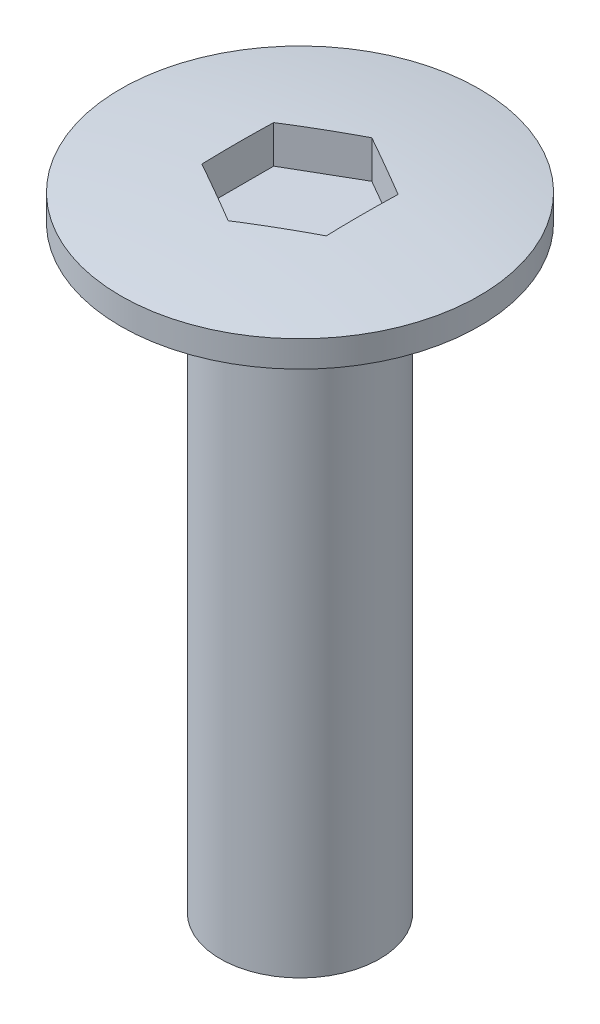
ISO-10303-21;
HEADER;
FILE_DESCRIPTION(('STEP AP214'),'2;1');
FILE_NAME('part.step','',(''),(''),'','','');
FILE_SCHEMA(('AUTOMOTIVE_DESIGN { 1 0 10303 214 1 1 1 1 }'));
ENDSEC;
DATA;
#1=APPLICATION_CONTEXT('core data for automotive mechanical design processes');
#2=APPLICATION_PROTOCOL_DEFINITION('international standard','automotive_design',2000,#1);
#3=PRODUCT_CONTEXT('',#1,'mechanical');
#4=PRODUCT('Part','Part','',(#3));
#5=PRODUCT_RELATED_PRODUCT_CATEGORY('part','',(#4));
#6=PRODUCT_DEFINITION_FORMATION('','',#4);
#7=PRODUCT_DEFINITION_CONTEXT('part definition',#1,'design');
#8=PRODUCT_DEFINITION('design','',#6,#7);
#9=PRODUCT_DEFINITION_SHAPE('','',#8);
#10=(LENGTH_UNIT() NAMED_UNIT(*) SI_UNIT(.MILLI.,.METRE.));
#11=(NAMED_UNIT(*) PLANE_ANGLE_UNIT() SI_UNIT($,.RADIAN.));
#12=(NAMED_UNIT(*) SI_UNIT($,.STERADIAN.) SOLID_ANGLE_UNIT());
#13=UNCERTAINTY_MEASURE_WITH_UNIT(LENGTH_MEASURE(1.E-05),#10,'distance_accuracy_value','');
#14=(GEOMETRIC_REPRESENTATION_CONTEXT(3) GLOBAL_UNCERTAINTY_ASSIGNED_CONTEXT((#13)) GLOBAL_UNIT_ASSIGNED_CONTEXT((#10,
#11,#12)) REPRESENTATION_CONTEXT('',''));
#15=CARTESIAN_POINT('',(0.,0.,0.));
#16=DIRECTION('',(0.,0.,1.));
#17=DIRECTION('',(1.,0.,0.));
#18=AXIS2_PLACEMENT_3D('',#15,#16,#17);
#19=CARTESIAN_POINT('',(0.,1.,0.));
#20=DIRECTION('',(0.,-1.,0.));
#21=DIRECTION('',(0.,0.,-1.));
#22=AXIS2_PLACEMENT_3D('',#19,#20,#21);
#23=CYLINDRICAL_SURFACE('',#22,4.5);
#24=CARTESIAN_POINT('',(0.,0.,0.));
#25=DIRECTION('',(0.,1.,0.));
#26=DIRECTION('',(0.,0.,1.));
#27=AXIS2_PLACEMENT_3D('',#24,#25,#26);
#28=CIRCLE('',#27,4.5);
#29=CARTESIAN_POINT('',(0.,0.,4.5));
#30=VERTEX_POINT('',#29);
#31=EDGE_CURVE('E127',#30,#30,#28,.T.);
#32=ORIENTED_EDGE('',*,*,#31,.T.);
#33=EDGE_LOOP('',(#32));
#34=FACE_BOUND('',#33,.T.);
#35=CARTESIAN_POINT('',(0.,0.66057989992778,0.));
#36=DIRECTION('',(0.,-1.,0.));
#37=DIRECTION('',(0.,0.,-1.));
#38=AXIS2_PLACEMENT_3D('',#35,#36,#37);
#39=CIRCLE('',#38,4.5);
#40=CARTESIAN_POINT('',(0.,0.66057989992778,-4.5));
#41=VERTEX_POINT('',#40);
#42=EDGE_CURVE('E116',#41,#41,#39,.F.);
#43=ORIENTED_EDGE('',*,*,#42,.F.);
#44=EDGE_LOOP('',(#43));
#45=FACE_BOUND('',#44,.T.);
#46=ADVANCED_FACE('F35',(#34,#45),#23,.T.);
#47=CARTESIAN_POINT('',(0.,0.,0.));
#48=DIRECTION('',(0.,1.,0.));
#49=DIRECTION('',(0.,0.,1.));
#50=AXIS2_PLACEMENT_3D('',#47,#48,#49);
#51=PLANE('',#50);
#52=CARTESIAN_POINT('',(0.,0.,0.));
#53=DIRECTION('',(0.,-1.,0.));
#54=DIRECTION('',(0.,0.,-1.));
#55=AXIS2_PLACEMENT_3D('',#52,#53,#54);
#56=CIRCLE('',#55,2.);
#57=CARTESIAN_POINT('',(0.,0.,-2.));
#58=VERTEX_POINT('',#57);
#59=EDGE_CURVE('E128',#58,#58,#56,.T.);
#60=ORIENTED_EDGE('',*,*,#59,.F.);
#61=EDGE_LOOP('',(#60));
#62=FACE_BOUND('',#61,.T.);
#63=ORIENTED_EDGE('',*,*,#31,.F.);
#64=EDGE_LOOP('',(#63));
#65=FACE_BOUND('',#64,.T.);
#66=ADVANCED_FACE('F169',(#62,#65),#51,.F.);
#67=CARTESIAN_POINT('',(0.,-15.,0.));
#68=DIRECTION('',(0.,1.,0.));
#69=DIRECTION('',(0.,0.,1.));
#70=AXIS2_PLACEMENT_3D('',#67,#68,#69);
#71=CYLINDRICAL_SURFACE('',#70,2.);
#72=CARTESIAN_POINT('',(0.,-15.,0.));
#73=DIRECTION('',(0.,-1.,0.));
#74=DIRECTION('',(0.,0.,-1.));
#75=AXIS2_PLACEMENT_3D('',#72,#73,#74);
#76=CIRCLE('',#75,2.);
#77=CARTESIAN_POINT('',(0.,-15.,-2.));
#78=VERTEX_POINT('',#77);
#79=EDGE_CURVE('E124',#78,#78,#76,.T.);
#80=ORIENTED_EDGE('',*,*,#79,.F.);
#81=EDGE_LOOP('',(#80));
#82=FACE_BOUND('',#81,.T.);
#83=ORIENTED_EDGE('',*,*,#59,.T.);
#84=EDGE_LOOP('',(#83));
#85=FACE_BOUND('',#84,.T.);
#86=ADVANCED_FACE('F174',(#82,#85),#71,.T.);
#87=CARTESIAN_POINT('',(0.,-15.,0.));
#88=DIRECTION('',(0.,-1.,0.));
#89=DIRECTION('',(0.,0.,-1.));
#90=AXIS2_PLACEMENT_3D('',#87,#88,#89);
#91=PLANE('',#90);
#92=ORIENTED_EDGE('',*,*,#79,.T.);
#93=EDGE_LOOP('',(#92));
#94=FACE_BOUND('',#93,.T.);
#95=ADVANCED_FACE('F180',(#94),#91,.T.);
#96=CARTESIAN_POINT('',(0.,-29.,0.));
#97=DIRECTION('',(0.,-1.,0.));
#98=DIRECTION('',(1.,0.,0.));
#99=AXIS2_PLACEMENT_3D('',#96,#97,#98);
#100=SPHERICAL_SURFACE('',#99,30.);
#101=CARTESIAN_POINT('',(-0.780455035167538,-29.,-1.35178777393315));
#102=DIRECTION('',(-0.499999999999995,0.,-0.866025403784441));
#103=DIRECTION('',(-0.866025403784442,0.,0.499999999999995));
#104=AXIS2_PLACEMENT_3D('',#101,#102,#103);
#105=CIRCLE('',#104,29.9593651426783);
#106=CARTESIAN_POINT('',(0.,0.945807937056932,-1.80238369857752));
#107=VERTEX_POINT('',#106);
#108=CARTESIAN_POINT('',(-1.56091007033508,0.945807937056932,-0.901191849288778));
#109=VERTEX_POINT('',#108);
#110=EDGE_CURVE('E11',#107,#109,#105,.F.);
#111=ORIENTED_EDGE('',*,*,#110,.F.);
#112=CARTESIAN_POINT('',(0.780455035167544,-29.,-1.35178777393314));
#113=DIRECTION('',(0.500000000000001,0.,-0.866025403784438));
#114=DIRECTION('',(-0.866025403784438,0.,-0.500000000000001));
#115=AXIS2_PLACEMENT_3D('',#112,#113,#114);
#116=CIRCLE('',#115,29.9593651426783);
#117=CARTESIAN_POINT('',(1.56091007033509,0.945807937056932,-0.901191849288756));
#118=VERTEX_POINT('',#117);
#119=EDGE_CURVE('E88',#118,#107,#116,.F.);
#120=ORIENTED_EDGE('',*,*,#119,.F.);
#121=CARTESIAN_POINT('',(1.56091007033509,-29.,0.));
#122=DIRECTION('',(1.,0.,0.));
#123=DIRECTION('',(0.,0.,-1.));
#124=AXIS2_PLACEMENT_3D('',#121,#122,#123);
#125=CIRCLE('',#124,29.9593651426783);
#126=CARTESIAN_POINT('',(1.56091007033508,0.945807937056932,0.901191849288767));
#127=VERTEX_POINT('',#126);
#128=EDGE_CURVE('E136',#127,#118,#125,.F.);
#129=ORIENTED_EDGE('',*,*,#128,.F.);
#130=CARTESIAN_POINT('',(0.780455035167535,-29.,1.35178777393314));
#131=DIRECTION('',(0.499999999999995,0.,0.866025403784442));
#132=DIRECTION('',(0.866025403784442,0.,-0.499999999999995));
#133=AXIS2_PLACEMENT_3D('',#130,#131,#132);
#134=CIRCLE('',#133,29.9593651426783);
#135=CARTESIAN_POINT('',(0.,0.945807937056932,1.80238369857752));
#136=VERTEX_POINT('',#135);
#137=EDGE_CURVE('E138',#136,#127,#134,.F.);
#138=ORIENTED_EDGE('',*,*,#137,.F.);
#139=CARTESIAN_POINT('',(-0.780455035167554,-29.,1.35178777393313));
#140=DIRECTION('',(-0.500000000000007,0.,0.866025403784435));
#141=DIRECTION('',(0.866025403784434,0.,0.500000000000007));
#142=AXIS2_PLACEMENT_3D('',#139,#140,#141);
#143=CIRCLE('',#142,29.9593651426783);
#144=CARTESIAN_POINT('',(-1.5609100703351,0.945807937056932,0.901191849288745));
#145=VERTEX_POINT('',#144);
#146=EDGE_CURVE('E140',#145,#136,#143,.F.);
#147=ORIENTED_EDGE('',*,*,#146,.F.);
#148=CARTESIAN_POINT('',(-1.56091007033509,-29.,0.));
#149=DIRECTION('',(-1.,0.,0.));
#150=DIRECTION('',(0.,0.,1.));
#151=AXIS2_PLACEMENT_3D('',#148,#149,#150);
#152=CIRCLE('',#151,29.9593651426783);
#153=EDGE_CURVE('E42',#109,#145,#152,.F.);
#154=ORIENTED_EDGE('',*,*,#153,.F.);
#155=EDGE_LOOP('',(#111,#120,#129,#138,#147,#154));
#156=FACE_BOUND('',#155,.T.);
#157=ORIENTED_EDGE('',*,*,#42,.T.);
#158=EDGE_LOOP('',(#157));
#159=FACE_BOUND('',#158,.T.);
#160=ADVANCED_FACE('F152',(#156,#159),#100,.T.);
#161=CARTESIAN_POINT('',(-1.56091007033508,1.,-0.901191849288778));
#162=DIRECTION('',(-0.499999999999995,0.,-0.866025403784441));
#163=DIRECTION('',(-0.866025403784442,0.,0.499999999999995));
#164=AXIS2_PLACEMENT_3D('',#161,#162,#163);
#165=PLANE('',#164);
#166=ORIENTED_EDGE('',*,*,#110,.T.);
#167=DIRECTION('',(0.,-1.,0.));
#168=VECTOR('',#167,1.);
#169=CARTESIAN_POINT('',(-1.56091007033508,1.,-0.901191849288778));
#170=LINE('',#169,#168);
#171=CARTESIAN_POINT('',(-1.56091007033508,0.,-0.901191849288778));
#172=VERTEX_POINT('',#171);
#173=EDGE_CURVE('E104',#109,#172,#170,.T.);
#174=ORIENTED_EDGE('',*,*,#173,.T.);
#175=DIRECTION('',(0.866025403784441,0.,-0.499999999999995));
#176=VECTOR('',#175,1.);
#177=CARTESIAN_POINT('',(-1.56091007033508,0.,-0.901191849288778));
#178=LINE('',#177,#176);
#179=CARTESIAN_POINT('',(0.,0.,-1.80238369857752));
#180=VERTEX_POINT('',#179);
#181=EDGE_CURVE('E97',#172,#180,#178,.T.);
#182=ORIENTED_EDGE('',*,*,#181,.T.);
#183=DIRECTION('',(0.,-1.,0.));
#184=VECTOR('',#183,1.);
#185=CARTESIAN_POINT('',(0.,1.,-1.80238369857752));
#186=LINE('',#185,#184);
#187=EDGE_CURVE('E83',#107,#180,#186,.T.);
#188=ORIENTED_EDGE('',*,*,#187,.F.);
#189=EDGE_LOOP('',(#166,#174,#182,#188));
#190=FACE_BOUND('',#189,.T.);
#191=ADVANCED_FACE('F103',(#190),#165,.F.);
#192=CARTESIAN_POINT('',(-1.56091007033509,1.,0.901191849288745));
#193=DIRECTION('',(-1.,0.,0.));
#194=DIRECTION('',(0.,0.,1.));
#195=AXIS2_PLACEMENT_3D('',#192,#193,#194);
#196=PLANE('',#195);
#197=ORIENTED_EDGE('',*,*,#153,.T.);
#198=DIRECTION('',(0.,-1.,0.));
#199=VECTOR('',#198,1.);
#200=CARTESIAN_POINT('',(-1.56091007033509,1.,0.901191849288745));
#201=LINE('',#200,#199);
#202=CARTESIAN_POINT('',(-1.56091007033509,0.,0.901191849288745));
#203=VERTEX_POINT('',#202);
#204=EDGE_CURVE('E117',#145,#203,#201,.T.);
#205=ORIENTED_EDGE('',*,*,#204,.T.);
#206=DIRECTION('',(0.,0.,-1.));
#207=VECTOR('',#206,1.);
#208=CARTESIAN_POINT('',(-1.56091007033509,0.,0.901191849288745));
#209=LINE('',#208,#207);
#210=EDGE_CURVE('E90',#203,#172,#209,.T.);
#211=ORIENTED_EDGE('',*,*,#210,.T.);
#212=ORIENTED_EDGE('',*,*,#173,.F.);
#213=EDGE_LOOP('',(#197,#205,#211,#212));
#214=FACE_BOUND('',#213,.T.);
#215=ADVANCED_FACE('F144',(#214),#196,.F.);
#216=CARTESIAN_POINT('',(0.,1.,1.80238369857752));
#217=DIRECTION('',(-0.500000000000007,0.,0.866025403784435));
#218=DIRECTION('',(0.866025403784434,0.,0.500000000000007));
#219=AXIS2_PLACEMENT_3D('',#216,#217,#218);
#220=PLANE('',#219);
#221=ORIENTED_EDGE('',*,*,#146,.T.);
#222=DIRECTION('',(0.,-1.,0.));
#223=VECTOR('',#222,1.);
#224=CARTESIAN_POINT('',(0.,1.,1.80238369857752));
#225=LINE('',#224,#223);
#226=CARTESIAN_POINT('',(0.,0.,1.80238369857752));
#227=VERTEX_POINT('',#226);
#228=EDGE_CURVE('E119',#136,#227,#225,.T.);
#229=ORIENTED_EDGE('',*,*,#228,.T.);
#230=DIRECTION('',(-0.866025403784435,0.,-0.500000000000007));
#231=VECTOR('',#230,1.);
#232=CARTESIAN_POINT('',(0.,0.,1.80238369857752));
#233=LINE('',#232,#231);
#234=EDGE_CURVE('E111',#227,#203,#233,.T.);
#235=ORIENTED_EDGE('',*,*,#234,.T.);
#236=ORIENTED_EDGE('',*,*,#204,.F.);
#237=EDGE_LOOP('',(#221,#229,#235,#236));
#238=FACE_BOUND('',#237,.T.);
#239=ADVANCED_FACE('F148',(#238),#220,.F.);
#240=CARTESIAN_POINT('',(1.56091007033508,1.,0.901191849288767));
#241=DIRECTION('',(0.499999999999995,0.,0.866025403784442));
#242=DIRECTION('',(0.866025403784442,0.,-0.499999999999995));
#243=AXIS2_PLACEMENT_3D('',#240,#241,#242);
#244=PLANE('',#243);
#245=ORIENTED_EDGE('',*,*,#137,.T.);
#246=DIRECTION('',(0.,-1.,0.));
#247=VECTOR('',#246,1.);
#248=CARTESIAN_POINT('',(1.56091007033508,1.,0.901191849288767));
#249=LINE('',#248,#247);
#250=CARTESIAN_POINT('',(1.56091007033508,0.,0.901191849288767));
#251=VERTEX_POINT('',#250);
#252=EDGE_CURVE('E121',#127,#251,#249,.T.);
#253=ORIENTED_EDGE('',*,*,#252,.T.);
#254=DIRECTION('',(-0.866025403784442,0.,0.499999999999995));
#255=VECTOR('',#254,1.);
#256=CARTESIAN_POINT('',(1.56091007033508,0.,0.901191849288767));
#257=LINE('',#256,#255);
#258=EDGE_CURVE('E108',#251,#227,#257,.T.);
#259=ORIENTED_EDGE('',*,*,#258,.T.);
#260=ORIENTED_EDGE('',*,*,#228,.F.);
#261=EDGE_LOOP('',(#245,#253,#259,#260));
#262=FACE_BOUND('',#261,.T.);
#263=ADVANCED_FACE('F157',(#262),#244,.F.);
#264=CARTESIAN_POINT('',(1.56091007033509,1.,-0.901191849288756));
#265=DIRECTION('',(1.,0.,0.));
#266=DIRECTION('',(0.,0.,-1.));
#267=AXIS2_PLACEMENT_3D('',#264,#265,#266);
#268=PLANE('',#267);
#269=ORIENTED_EDGE('',*,*,#128,.T.);
#270=DIRECTION('',(0.,-1.,0.));
#271=VECTOR('',#270,1.);
#272=CARTESIAN_POINT('',(1.56091007033509,1.,-0.901191849288756));
#273=LINE('',#272,#271);
#274=CARTESIAN_POINT('',(1.56091007033509,0.,-0.901191849288756));
#275=VERTEX_POINT('',#274);
#276=EDGE_CURVE('E49',#118,#275,#273,.T.);
#277=ORIENTED_EDGE('',*,*,#276,.T.);
#278=DIRECTION('',(0.,0.,1.));
#279=VECTOR('',#278,1.);
#280=CARTESIAN_POINT('',(1.56091007033509,0.,-0.901191849288756));
#281=LINE('',#280,#279);
#282=EDGE_CURVE('E101',#275,#251,#281,.T.);
#283=ORIENTED_EDGE('',*,*,#282,.T.);
#284=ORIENTED_EDGE('',*,*,#252,.F.);
#285=EDGE_LOOP('',(#269,#277,#283,#284));
#286=FACE_BOUND('',#285,.T.);
#287=ADVANCED_FACE('F159',(#286),#268,.F.);
#288=CARTESIAN_POINT('',(0.,1.,-1.80238369857752));
#289=DIRECTION('',(0.500000000000001,0.,-0.866025403784438));
#290=DIRECTION('',(-0.866025403784438,0.,-0.500000000000001));
#291=AXIS2_PLACEMENT_3D('',#288,#289,#290);
#292=PLANE('',#291);
#293=ORIENTED_EDGE('',*,*,#119,.T.);
#294=ORIENTED_EDGE('',*,*,#187,.T.);
#295=DIRECTION('',(0.866025403784438,0.,0.500000000000001));
#296=VECTOR('',#295,1.);
#297=CARTESIAN_POINT('',(0.,0.,-1.80238369857752));
#298=LINE('',#297,#296);
#299=EDGE_CURVE('E86',#180,#275,#298,.T.);
#300=ORIENTED_EDGE('',*,*,#299,.T.);
#301=ORIENTED_EDGE('',*,*,#276,.F.);
#302=EDGE_LOOP('',(#293,#294,#300,#301));
#303=FACE_BOUND('',#302,.T.);
#304=ADVANCED_FACE('F85',(#303),#292,.F.);
#305=CARTESIAN_POINT('',(0.,0.,0.));
#306=DIRECTION('',(0.,-1.,0.));
#307=DIRECTION('',(0.,0.,-1.));
#308=AXIS2_PLACEMENT_3D('',#305,#306,#307);
#309=PLANE('',#308);
#310=ORIENTED_EDGE('',*,*,#181,.F.);
#311=ORIENTED_EDGE('',*,*,#210,.F.);
#312=ORIENTED_EDGE('',*,*,#234,.F.);
#313=ORIENTED_EDGE('',*,*,#258,.F.);
#314=ORIENTED_EDGE('',*,*,#282,.F.);
#315=ORIENTED_EDGE('',*,*,#299,.F.);
#316=EDGE_LOOP('',(#310,#311,#312,#313,#314,#315));
#317=FACE_BOUND('',#316,.T.);
#318=ADVANCED_FACE('F95',(#317),#309,.F.);
#319=CLOSED_SHELL('',(#46,#66,#86,#95,#160,#191,#215,#239,#263,#287,#304,#318));
#320=MANIFOLD_SOLID_BREP('B2',#319);
#321=ADVANCED_BREP_SHAPE_REPRESENTATION('',(#18,#320),#14);
#322=SHAPE_DEFINITION_REPRESENTATION(#9,#321);
ENDSEC;
END-ISO-10303-21;
